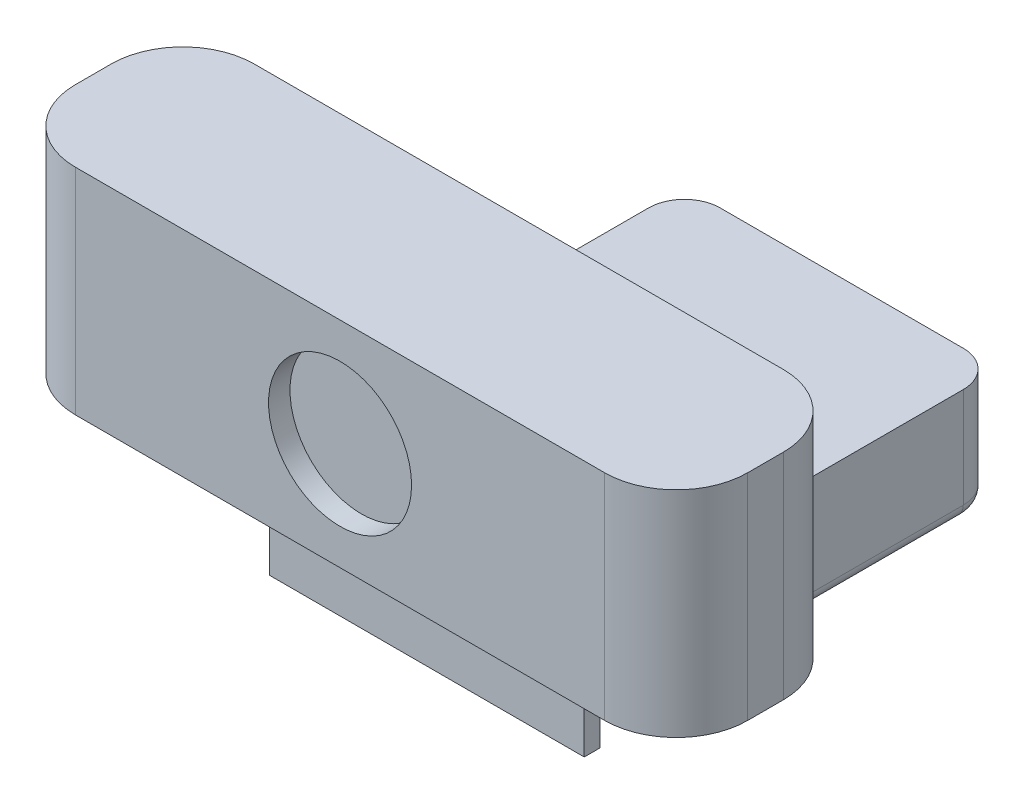
ISO-10303-21;
HEADER;
FILE_DESCRIPTION(('STEP AP214'),'2;1');
FILE_NAME('part.step','',(''),(''),'','','');
FILE_SCHEMA(('AUTOMOTIVE_DESIGN { 1 0 10303 214 1 1 1 1 }'));
ENDSEC;
DATA;
#1=APPLICATION_CONTEXT('core data for automotive mechanical design processes');
#2=APPLICATION_PROTOCOL_DEFINITION('international standard','automotive_design',2000,#1);
#3=PRODUCT_CONTEXT('',#1,'mechanical');
#4=PRODUCT('Part','Part','',(#3));
#5=PRODUCT_RELATED_PRODUCT_CATEGORY('part','',(#4));
#6=PRODUCT_DEFINITION_FORMATION('','',#4);
#7=PRODUCT_DEFINITION_CONTEXT('part definition',#1,'design');
#8=PRODUCT_DEFINITION('design','',#6,#7);
#9=PRODUCT_DEFINITION_SHAPE('','',#8);
#10=(LENGTH_UNIT() NAMED_UNIT(*) SI_UNIT(.MILLI.,.METRE.));
#11=(NAMED_UNIT(*) PLANE_ANGLE_UNIT() SI_UNIT($,.RADIAN.));
#12=(NAMED_UNIT(*) SI_UNIT($,.STERADIAN.) SOLID_ANGLE_UNIT());
#13=UNCERTAINTY_MEASURE_WITH_UNIT(LENGTH_MEASURE(1.E-05),#10,'distance_accuracy_value','');
#14=(GEOMETRIC_REPRESENTATION_CONTEXT(3) GLOBAL_UNCERTAINTY_ASSIGNED_CONTEXT((#13)) GLOBAL_UNIT_ASSIGNED_CONTEXT((#10,
#11,#12)) REPRESENTATION_CONTEXT('',''));
#15=CARTESIAN_POINT('',(0.,0.,0.));
#16=DIRECTION('',(0.,0.,1.));
#17=DIRECTION('',(1.,0.,0.));
#18=AXIS2_PLACEMENT_3D('',#15,#16,#17);
#19=CARTESIAN_POINT('',(22.,10.,-25.));
#20=DIRECTION('',(-1.,0.,0.));
#21=DIRECTION('',(0.,0.,1.));
#22=AXIS2_PLACEMENT_3D('',#19,#20,#21);
#23=PLANE('',#22);
#24=DIRECTION('',(0.,-1.,0.));
#25=VECTOR('',#24,1.);
#26=CARTESIAN_POINT('',(22.,10.,20.));
#27=LINE('',#26,#25);
#28=CARTESIAN_POINT('',(22.,9.99999999999999,20.));
#29=VERTEX_POINT('',#28);
#30=CARTESIAN_POINT('',(22.,2.,20.));
#31=VERTEX_POINT('',#30);
#32=EDGE_CURVE('E310',#29,#31,#27,.T.);
#33=ORIENTED_EDGE('',*,*,#32,.T.);
#34=DIRECTION('',(0.,0.,-1.));
#35=VECTOR('',#34,1.);
#36=CARTESIAN_POINT('',(22.,2.,-25.));
#37=LINE('',#36,#35);
#38=CARTESIAN_POINT('',(22.,2.,-20.));
#39=VERTEX_POINT('',#38);
#40=EDGE_CURVE('E372',#31,#39,#37,.T.);
#41=ORIENTED_EDGE('',*,*,#40,.T.);
#42=DIRECTION('',(0.,-1.,0.));
#43=VECTOR('',#42,1.);
#44=CARTESIAN_POINT('',(22.,10.,-20.));
#45=LINE('',#44,#43);
#46=CARTESIAN_POINT('',(22.,16.,-20.));
#47=VERTEX_POINT('',#46);
#48=EDGE_CURVE('E313',#39,#47,#45,.F.);
#49=ORIENTED_EDGE('',*,*,#48,.T.);
#50=DIRECTION('',(0.,0.,1.));
#51=VECTOR('',#50,1.);
#52=CARTESIAN_POINT('',(22.,16.,-25.));
#53=LINE('',#52,#51);
#54=CARTESIAN_POINT('',(22.,16.,20.1472553699283));
#55=VERTEX_POINT('',#54);
#56=EDGE_CURVE('E268',#47,#55,#53,.T.);
#57=ORIENTED_EDGE('',*,*,#56,.T.);
#58=CARTESIAN_POINT('',(22.,16.,33.));
#59=VERTEX_POINT('',#58);
#60=EDGE_CURVE('E271',#55,#59,#53,.T.);
#61=ORIENTED_EDGE('',*,*,#60,.T.);
#62=DIRECTION('',(0.,-1.,0.));
#63=VECTOR('',#62,1.);
#64=CARTESIAN_POINT('',(22.,10.,33.));
#65=LINE('',#64,#63);
#66=CARTESIAN_POINT('',(22.,-2.00000000000001,33.));
#67=VERTEX_POINT('',#66);
#68=EDGE_CURVE('E270',#59,#67,#65,.T.);
#69=ORIENTED_EDGE('',*,*,#68,.T.);
#70=DIRECTION('',(0.,0.,-1.));
#71=VECTOR('',#70,1.);
#72=CARTESIAN_POINT('',(22.,-2.00000000000001,33.));
#73=LINE('',#72,#71);
#74=CARTESIAN_POINT('',(22.,-2.00000000000001,30.8));
#75=VERTEX_POINT('',#74);
#76=EDGE_CURVE('E274',#67,#75,#73,.T.);
#77=ORIENTED_EDGE('',*,*,#76,.T.);
#78=DIRECTION('',(0.,1.,0.));
#79=VECTOR('',#78,1.);
#80=CARTESIAN_POINT('',(22.,9.99999999999999,30.8));
#81=LINE('',#80,#79);
#82=CARTESIAN_POINT('',(22.,9.99999999999999,30.8));
#83=VERTEX_POINT('',#82);
#84=EDGE_CURVE('E277',#75,#83,#81,.T.);
#85=ORIENTED_EDGE('',*,*,#84,.T.);
#86=DIRECTION('',(0.,0.,-1.));
#87=VECTOR('',#86,1.);
#88=CARTESIAN_POINT('',(22.,10.,-25.));
#89=LINE('',#88,#87);
#90=EDGE_CURVE('E280',#83,#29,#89,.T.);
#91=ORIENTED_EDGE('',*,*,#90,.T.);
#92=EDGE_LOOP('',(#33,#41,#49,#57,#61,#69,#77,#85,#91));
#93=FACE_BOUND('',#92,.T.);
#94=ADVANCED_FACE('F35',(#93),#23,.F.);
#95=CARTESIAN_POINT('',(-22.,10.,-25.));
#96=DIRECTION('',(0.,0.,1.));
#97=DIRECTION('',(1.,0.,0.));
#98=AXIS2_PLACEMENT_3D('',#95,#96,#97);
#99=PLANE('',#98);
#100=DIRECTION('',(0.,-1.,0.));
#101=VECTOR('',#100,1.);
#102=CARTESIAN_POINT('',(17.,10.,-25.));
#103=LINE('',#102,#101);
#104=CARTESIAN_POINT('',(17.,16.,-25.));
#105=VERTEX_POINT('',#104);
#106=CARTESIAN_POINT('',(17.,2.,-25.));
#107=VERTEX_POINT('',#106);
#108=EDGE_CURVE('E302',#105,#107,#103,.T.);
#109=ORIENTED_EDGE('',*,*,#108,.T.);
#110=DIRECTION('',(-1.,0.,0.));
#111=VECTOR('',#110,1.);
#112=CARTESIAN_POINT('',(-22.,2.,-25.));
#113=LINE('',#112,#111);
#114=CARTESIAN_POINT('',(-17.,2.,-25.));
#115=VERTEX_POINT('',#114);
#116=EDGE_CURVE('E376',#107,#115,#113,.T.);
#117=ORIENTED_EDGE('',*,*,#116,.T.);
#118=DIRECTION('',(0.,-1.,0.));
#119=VECTOR('',#118,1.);
#120=CARTESIAN_POINT('',(-17.,10.,-25.));
#121=LINE('',#120,#119);
#122=CARTESIAN_POINT('',(-17.,16.,-25.));
#123=VERTEX_POINT('',#122);
#124=EDGE_CURVE('E305',#115,#123,#121,.F.);
#125=ORIENTED_EDGE('',*,*,#124,.T.);
#126=DIRECTION('',(1.,0.,0.));
#127=VECTOR('',#126,1.);
#128=CARTESIAN_POINT('',(-82.7289058027559,16.,-25.));
#129=LINE('',#128,#127);
#130=EDGE_CURVE('E282',#123,#105,#129,.T.);
#131=ORIENTED_EDGE('',*,*,#130,.T.);
#132=EDGE_LOOP('',(#109,#117,#125,#131));
#133=FACE_BOUND('',#132,.T.);
#134=ADVANCED_FACE('F475',(#133),#99,.F.);
#135=CARTESIAN_POINT('',(-22.,10.,-25.));
#136=DIRECTION('',(1.,0.,0.));
#137=DIRECTION('',(0.,0.,-1.));
#138=AXIS2_PLACEMENT_3D('',#135,#136,#137);
#139=PLANE('',#138);
#140=DIRECTION('',(0.,-1.,0.));
#141=VECTOR('',#140,1.);
#142=CARTESIAN_POINT('',(-22.,10.,-20.));
#143=LINE('',#142,#141);
#144=CARTESIAN_POINT('',(-22.,16.,-20.));
#145=VERTEX_POINT('',#144);
#146=CARTESIAN_POINT('',(-22.,2.,-20.));
#147=VERTEX_POINT('',#146);
#148=EDGE_CURVE('E298',#145,#147,#143,.T.);
#149=ORIENTED_EDGE('',*,*,#148,.T.);
#150=DIRECTION('',(0.,0.,1.));
#151=VECTOR('',#150,1.);
#152=CARTESIAN_POINT('',(-22.,2.,-25.));
#153=LINE('',#152,#151);
#154=CARTESIAN_POINT('',(-22.,2.,20.));
#155=VERTEX_POINT('',#154);
#156=EDGE_CURVE('E60',#147,#155,#153,.T.);
#157=ORIENTED_EDGE('',*,*,#156,.T.);
#158=DIRECTION('',(0.,-1.,0.));
#159=VECTOR('',#158,1.);
#160=CARTESIAN_POINT('',(-22.,10.,20.));
#161=LINE('',#160,#159);
#162=CARTESIAN_POINT('',(-22.,9.99999999999999,20.));
#163=VERTEX_POINT('',#162);
#164=EDGE_CURVE('E300',#155,#163,#161,.F.);
#165=ORIENTED_EDGE('',*,*,#164,.T.);
#166=DIRECTION('',(0.,0.,1.));
#167=VECTOR('',#166,1.);
#168=CARTESIAN_POINT('',(-22.,10.,-25.));
#169=LINE('',#168,#167);
#170=CARTESIAN_POINT('',(-22.,9.99999999999999,30.8));
#171=VERTEX_POINT('',#170);
#172=EDGE_CURVE('E228',#163,#171,#169,.T.);
#173=ORIENTED_EDGE('',*,*,#172,.T.);
#174=DIRECTION('',(0.,-1.,0.));
#175=VECTOR('',#174,1.);
#176=CARTESIAN_POINT('',(-22.,9.99999999999999,30.8));
#177=LINE('',#176,#175);
#178=CARTESIAN_POINT('',(-22.,-2.00000000000001,30.8));
#179=VERTEX_POINT('',#178);
#180=EDGE_CURVE('E265',#171,#179,#177,.T.);
#181=ORIENTED_EDGE('',*,*,#180,.T.);
#182=DIRECTION('',(0.,0.,1.));
#183=VECTOR('',#182,1.);
#184=CARTESIAN_POINT('',(-22.,-2.00000000000001,33.));
#185=LINE('',#184,#183);
#186=CARTESIAN_POINT('',(-22.,-2.00000000000001,33.));
#187=VERTEX_POINT('',#186);
#188=EDGE_CURVE('E262',#179,#187,#185,.T.);
#189=ORIENTED_EDGE('',*,*,#188,.T.);
#190=DIRECTION('',(0.,1.,0.));
#191=VECTOR('',#190,1.);
#192=CARTESIAN_POINT('',(-22.,10.,33.));
#193=LINE('',#192,#191);
#194=CARTESIAN_POINT('',(-22.,16.,33.));
#195=VERTEX_POINT('',#194);
#196=EDGE_CURVE('E210',#187,#195,#193,.T.);
#197=ORIENTED_EDGE('',*,*,#196,.T.);
#198=DIRECTION('',(0.,0.,-1.));
#199=VECTOR('',#198,1.);
#200=CARTESIAN_POINT('',(-22.,16.,-25.));
#201=LINE('',#200,#199);
#202=CARTESIAN_POINT('',(-22.,16.,20.1472553699283));
#203=VERTEX_POINT('',#202);
#204=EDGE_CURVE('E204',#195,#203,#201,.T.);
#205=ORIENTED_EDGE('',*,*,#204,.T.);
#206=EDGE_CURVE('E207',#203,#145,#201,.T.);
#207=ORIENTED_EDGE('',*,*,#206,.T.);
#208=EDGE_LOOP('',(#149,#157,#165,#173,#181,#189,#197,#205,#207));
#209=FACE_BOUND('',#208,.T.);
#210=ADVANCED_FACE('F206',(#209),#139,.F.);
#211=CARTESIAN_POINT('',(-22.,10.,25.));
#212=DIRECTION('',(0.,0.,-1.));
#213=DIRECTION('',(-1.,0.,0.));
#214=AXIS2_PLACEMENT_3D('',#211,#212,#213);
#215=PLANE('',#214);
#216=DIRECTION('',(0.,-1.,0.));
#217=VECTOR('',#216,1.);
#218=CARTESIAN_POINT('',(-17.,10.,25.));
#219=LINE('',#218,#217);
#220=CARTESIAN_POINT('',(-17.,10.,25.));
#221=VERTEX_POINT('',#220);
#222=CARTESIAN_POINT('',(-17.,2.,25.));
#223=VERTEX_POINT('',#222);
#224=EDGE_CURVE('E296',#221,#223,#219,.T.);
#225=ORIENTED_EDGE('',*,*,#224,.T.);
#226=DIRECTION('',(1.,0.,0.));
#227=VECTOR('',#226,1.);
#228=CARTESIAN_POINT('',(-22.,2.,25.));
#229=LINE('',#228,#227);
#230=CARTESIAN_POINT('',(17.,2.,25.));
#231=VERTEX_POINT('',#230);
#232=EDGE_CURVE('E44',#223,#231,#229,.T.);
#233=ORIENTED_EDGE('',*,*,#232,.T.);
#234=DIRECTION('',(0.,-1.,0.));
#235=VECTOR('',#234,1.);
#236=CARTESIAN_POINT('',(17.,10.,25.));
#237=LINE('',#236,#235);
#238=CARTESIAN_POINT('',(17.,10.,25.));
#239=VERTEX_POINT('',#238);
#240=EDGE_CURVE('E294',#231,#239,#237,.F.);
#241=ORIENTED_EDGE('',*,*,#240,.T.);
#242=DIRECTION('',(1.,0.,0.));
#243=VECTOR('',#242,1.);
#244=CARTESIAN_POINT('',(-22.,10.,25.));
#245=LINE('',#244,#243);
#246=EDGE_CURVE('E215',#221,#239,#245,.T.);
#247=ORIENTED_EDGE('',*,*,#246,.F.);
#248=EDGE_LOOP('',(#225,#233,#241,#247));
#249=FACE_BOUND('',#248,.T.);
#250=ADVANCED_FACE('F600',(#249),#215,.F.);
#251=CARTESIAN_POINT('',(0.,0.,0.));
#252=DIRECTION('',(0.,1.,0.));
#253=DIRECTION('',(0.,0.,1.));
#254=AXIS2_PLACEMENT_3D('',#251,#252,#253);
#255=PLANE('',#254);
#256=DIRECTION('',(0.,0.,-1.));
#257=VECTOR('',#256,1.);
#258=CARTESIAN_POINT('',(20.,0.,0.));
#259=LINE('',#258,#257);
#260=CARTESIAN_POINT('',(20.,0.,-20.));
#261=VERTEX_POINT('',#260);
#262=CARTESIAN_POINT('',(20.,0.,20.));
#263=VERTEX_POINT('',#262);
#264=EDGE_CURVE('E364',#261,#263,#259,.F.);
#265=ORIENTED_EDGE('',*,*,#264,.T.);
#266=CARTESIAN_POINT('',(17.,0.,20.));
#267=DIRECTION('',(0.,1.,0.));
#268=DIRECTION('',(0.,0.,1.));
#269=AXIS2_PLACEMENT_3D('',#266,#267,#268);
#270=CIRCLE('',#269,3.);
#271=CARTESIAN_POINT('',(17.,0.,23.));
#272=VERTEX_POINT('',#271);
#273=EDGE_CURVE('E366',#263,#272,#270,.F.);
#274=ORIENTED_EDGE('',*,*,#273,.T.);
#275=DIRECTION('',(1.,0.,0.));
#276=VECTOR('',#275,1.);
#277=CARTESIAN_POINT('',(0.,0.,23.));
#278=LINE('',#277,#276);
#279=CARTESIAN_POINT('',(-17.,0.,23.));
#280=VERTEX_POINT('',#279);
#281=EDGE_CURVE('E352',#272,#280,#278,.F.);
#282=ORIENTED_EDGE('',*,*,#281,.T.);
#283=CARTESIAN_POINT('',(-17.,0.,20.));
#284=DIRECTION('',(0.,1.,0.));
#285=DIRECTION('',(0.,0.,1.));
#286=AXIS2_PLACEMENT_3D('',#283,#284,#285);
#287=CIRCLE('',#286,3.);
#288=CARTESIAN_POINT('',(-20.,0.,20.));
#289=VERTEX_POINT('',#288);
#290=EDGE_CURVE('E354',#280,#289,#287,.F.);
#291=ORIENTED_EDGE('',*,*,#290,.T.);
#292=DIRECTION('',(0.,0.,1.));
#293=VECTOR('',#292,1.);
#294=CARTESIAN_POINT('',(-20.,0.,0.));
#295=LINE('',#294,#293);
#296=CARTESIAN_POINT('',(-20.,0.,-20.));
#297=VERTEX_POINT('',#296);
#298=EDGE_CURVE('E356',#289,#297,#295,.F.);
#299=ORIENTED_EDGE('',*,*,#298,.T.);
#300=CARTESIAN_POINT('',(-17.,0.,-20.));
#301=DIRECTION('',(0.,1.,0.));
#302=DIRECTION('',(0.,0.,1.));
#303=AXIS2_PLACEMENT_3D('',#300,#301,#302);
#304=CIRCLE('',#303,3.);
#305=CARTESIAN_POINT('',(-17.,0.,-23.));
#306=VERTEX_POINT('',#305);
#307=EDGE_CURVE('E358',#297,#306,#304,.F.);
#308=ORIENTED_EDGE('',*,*,#307,.T.);
#309=DIRECTION('',(-1.,0.,0.));
#310=VECTOR('',#309,1.);
#311=CARTESIAN_POINT('',(0.,0.,-23.));
#312=LINE('',#311,#310);
#313=CARTESIAN_POINT('',(17.,0.,-23.));
#314=VERTEX_POINT('',#313);
#315=EDGE_CURVE('E360',#306,#314,#312,.F.);
#316=ORIENTED_EDGE('',*,*,#315,.T.);
#317=CARTESIAN_POINT('',(17.,0.,-20.));
#318=DIRECTION('',(0.,1.,0.));
#319=DIRECTION('',(0.,0.,1.));
#320=AXIS2_PLACEMENT_3D('',#317,#318,#319);
#321=CIRCLE('',#320,3.);
#322=EDGE_CURVE('E362',#314,#261,#321,.F.);
#323=ORIENTED_EDGE('',*,*,#322,.T.);
#324=EDGE_LOOP('',(#265,#274,#282,#291,#299,#308,#316,#323));
#325=FACE_BOUND('',#324,.T.);
#326=CARTESIAN_POINT('',(0.,0.,4.99999999999999));
#327=DIRECTION('',(0.,1.,0.));
#328=DIRECTION('',(0.,0.,1.));
#329=AXIS2_PLACEMENT_3D('',#326,#327,#328);
#330=CIRCLE('',#329,4.32842712474618);
#331=CARTESIAN_POINT('',(0.,0.,9.32842712474618));
#332=VERTEX_POINT('',#331);
#333=EDGE_CURVE('E349',#332,#332,#330,.T.);
#334=ORIENTED_EDGE('',*,*,#333,.T.);
#335=EDGE_LOOP('',(#334));
#336=FACE_BOUND('',#335,.T.);
#337=ADVANCED_FACE('F583',(#325,#336),#255,.F.);
#338=CARTESIAN_POINT('',(-82.7289058027559,10.,-25.));
#339=DIRECTION('',(0.,-1.,0.));
#340=DIRECTION('',(0.,0.,-1.));
#341=AXIS2_PLACEMENT_3D('',#338,#339,#340);
#342=PLANE('',#341);
#343=ORIENTED_EDGE('',*,*,#172,.F.);
#344=CARTESIAN_POINT('',(-17.,9.99999999999999,20.));
#345=DIRECTION('',(0.,-1.,0.));
#346=DIRECTION('',(0.,0.,-1.));
#347=AXIS2_PLACEMENT_3D('',#344,#345,#346);
#348=CIRCLE('',#347,5.);
#349=EDGE_CURVE('E247',#163,#221,#348,.F.);
#350=ORIENTED_EDGE('',*,*,#349,.T.);
#351=ORIENTED_EDGE('',*,*,#246,.T.);
#352=CARTESIAN_POINT('',(17.,9.99999999999999,20.));
#353=DIRECTION('',(0.,-1.,0.));
#354=DIRECTION('',(0.,0.,-1.));
#355=AXIS2_PLACEMENT_3D('',#352,#353,#354);
#356=CIRCLE('',#355,5.);
#357=EDGE_CURVE('E243',#239,#29,#356,.F.);
#358=ORIENTED_EDGE('',*,*,#357,.T.);
#359=ORIENTED_EDGE('',*,*,#90,.F.);
#360=DIRECTION('',(1.,0.,0.));
#361=VECTOR('',#360,1.);
#362=CARTESIAN_POINT('',(-82.7289058027559,9.99999999999999,30.8));
#363=LINE('',#362,#361);
#364=EDGE_CURVE('E263',#171,#83,#363,.T.);
#365=ORIENTED_EDGE('',*,*,#364,.F.);
#366=EDGE_LOOP('',(#343,#350,#351,#358,#359,#365));
#367=FACE_BOUND('',#366,.T.);
#368=ADVANCED_FACE('F579',(#367),#342,.T.);
#369=CARTESIAN_POINT('',(-82.7289058027559,9.99999999999999,30.8));
#370=DIRECTION('',(0.,0.,-1.));
#371=DIRECTION('',(-1.,0.,0.));
#372=AXIS2_PLACEMENT_3D('',#369,#370,#371);
#373=PLANE('',#372);
#374=ORIENTED_EDGE('',*,*,#180,.F.);
#375=ORIENTED_EDGE('',*,*,#364,.T.);
#376=ORIENTED_EDGE('',*,*,#84,.F.);
#377=DIRECTION('',(1.,0.,0.));
#378=VECTOR('',#377,1.);
#379=CARTESIAN_POINT('',(-82.7289058027559,-2.00000000000001,30.8));
#380=LINE('',#379,#378);
#381=EDGE_CURVE('E284',#179,#75,#380,.T.);
#382=ORIENTED_EDGE('',*,*,#381,.F.);
#383=EDGE_LOOP('',(#374,#375,#376,#382));
#384=FACE_BOUND('',#383,.T.);
#385=ADVANCED_FACE('F582',(#384),#373,.T.);
#386=CARTESIAN_POINT('',(-82.7289058027559,-2.00000000000001,33.));
#387=DIRECTION('',(0.,-1.,0.));
#388=DIRECTION('',(0.,0.,-1.));
#389=AXIS2_PLACEMENT_3D('',#386,#387,#388);
#390=PLANE('',#389);
#391=ORIENTED_EDGE('',*,*,#188,.F.);
#392=ORIENTED_EDGE('',*,*,#381,.T.);
#393=ORIENTED_EDGE('',*,*,#76,.F.);
#394=DIRECTION('',(1.,0.,0.));
#395=VECTOR('',#394,1.);
#396=CARTESIAN_POINT('',(-82.7289058027559,-2.00000000000001,33.));
#397=LINE('',#396,#395);
#398=EDGE_CURVE('E286',#187,#67,#397,.T.);
#399=ORIENTED_EDGE('',*,*,#398,.F.);
#400=EDGE_LOOP('',(#391,#392,#393,#399));
#401=FACE_BOUND('',#400,.T.);
#402=ADVANCED_FACE('F587',(#401),#390,.T.);
#403=CARTESIAN_POINT('',(-82.7289058027559,10.,33.));
#404=DIRECTION('',(0.,0.,1.));
#405=DIRECTION('',(1.,0.,0.));
#406=AXIS2_PLACEMENT_3D('',#403,#404,#405);
#407=PLANE('',#406);
#408=ORIENTED_EDGE('',*,*,#196,.F.);
#409=ORIENTED_EDGE('',*,*,#398,.T.);
#410=ORIENTED_EDGE('',*,*,#68,.F.);
#411=DIRECTION('',(1.,0.,0.));
#412=VECTOR('',#411,1.);
#413=CARTESIAN_POINT('',(-82.7289058027559,16.,33.));
#414=LINE('',#413,#412);
#415=EDGE_CURVE('E288',#195,#59,#414,.T.);
#416=ORIENTED_EDGE('',*,*,#415,.F.);
#417=EDGE_LOOP('',(#408,#409,#410,#416));
#418=FACE_BOUND('',#417,.T.);
#419=ADVANCED_FACE('F591',(#418),#407,.T.);
#420=CARTESIAN_POINT('',(-82.7289058027559,16.,-25.));
#421=DIRECTION('',(0.,1.,0.));
#422=DIRECTION('',(0.,0.,1.));
#423=AXIS2_PLACEMENT_3D('',#420,#421,#422);
#424=PLANE('',#423);
#425=DIRECTION('',(-1.,0.,0.));
#426=VECTOR('',#425,1.);
#427=CARTESIAN_POINT('',(-47.,16.,20.1472553699283));
#428=LINE('',#427,#426);
#429=EDGE_CURVE('E222',#55,#203,#428,.T.);
#430=ORIENTED_EDGE('',*,*,#429,.F.);
#431=ORIENTED_EDGE('',*,*,#56,.F.);
#432=CARTESIAN_POINT('',(17.,16.,-20.));
#433=DIRECTION('',(0.,1.,0.));
#434=DIRECTION('',(0.,0.,1.));
#435=AXIS2_PLACEMENT_3D('',#432,#433,#434);
#436=CIRCLE('',#435,5.);
#437=EDGE_CURVE('E307',#47,#105,#436,.T.);
#438=ORIENTED_EDGE('',*,*,#437,.T.);
#439=ORIENTED_EDGE('',*,*,#130,.F.);
#440=CARTESIAN_POINT('',(-17.,16.,-20.));
#441=DIRECTION('',(0.,1.,0.));
#442=DIRECTION('',(0.,0.,1.));
#443=AXIS2_PLACEMENT_3D('',#440,#441,#442);
#444=CIRCLE('',#443,5.);
#445=EDGE_CURVE('E226',#123,#145,#444,.T.);
#446=ORIENTED_EDGE('',*,*,#445,.T.);
#447=ORIENTED_EDGE('',*,*,#206,.F.);
#448=EDGE_LOOP('',(#430,#431,#438,#439,#446,#447));
#449=FACE_BOUND('',#448,.T.);
#450=ADVANCED_FACE('F219',(#449),#424,.T.);
#451=CARTESIAN_POINT('',(-17.,10.,20.));
#452=DIRECTION('',(0.,-1.,0.));
#453=DIRECTION('',(0.,0.,-1.));
#454=AXIS2_PLACEMENT_3D('',#451,#452,#453);
#455=CYLINDRICAL_SURFACE('',#454,5.);
#456=ORIENTED_EDGE('',*,*,#164,.F.);
#457=CARTESIAN_POINT('',(-17.,2.,20.));
#458=DIRECTION('',(0.,1.,0.));
#459=DIRECTION('',(0.,0.,1.));
#460=AXIS2_PLACEMENT_3D('',#457,#458,#459);
#461=CIRCLE('',#460,5.);
#462=EDGE_CURVE('E52',#155,#223,#461,.T.);
#463=ORIENTED_EDGE('',*,*,#462,.T.);
#464=ORIENTED_EDGE('',*,*,#224,.F.);
#465=ORIENTED_EDGE('',*,*,#349,.F.);
#466=EDGE_LOOP('',(#456,#463,#464,#465));
#467=FACE_BOUND('',#466,.T.);
#468=ADVANCED_FACE('F486',(#467),#455,.T.);
#469=CARTESIAN_POINT('',(-17.,10.,-20.));
#470=DIRECTION('',(0.,-1.,0.));
#471=DIRECTION('',(0.,0.,-1.));
#472=AXIS2_PLACEMENT_3D('',#469,#470,#471);
#473=CYLINDRICAL_SURFACE('',#472,5.);
#474=ORIENTED_EDGE('',*,*,#124,.F.);
#475=CARTESIAN_POINT('',(-17.,2.,-20.));
#476=DIRECTION('',(0.,1.,0.));
#477=DIRECTION('',(0.,0.,1.));
#478=AXIS2_PLACEMENT_3D('',#475,#476,#477);
#479=CIRCLE('',#478,5.);
#480=EDGE_CURVE('E378',#115,#147,#479,.T.);
#481=ORIENTED_EDGE('',*,*,#480,.T.);
#482=ORIENTED_EDGE('',*,*,#148,.F.);
#483=ORIENTED_EDGE('',*,*,#445,.F.);
#484=EDGE_LOOP('',(#474,#481,#482,#483));
#485=FACE_BOUND('',#484,.T.);
#486=ADVANCED_FACE('F489',(#485),#473,.T.);
#487=CARTESIAN_POINT('',(17.,10.,-20.));
#488=DIRECTION('',(0.,-1.,0.));
#489=DIRECTION('',(0.,0.,-1.));
#490=AXIS2_PLACEMENT_3D('',#487,#488,#489);
#491=CYLINDRICAL_SURFACE('',#490,5.);
#492=ORIENTED_EDGE('',*,*,#48,.F.);
#493=CARTESIAN_POINT('',(17.,2.,-20.));
#494=DIRECTION('',(0.,1.,0.));
#495=DIRECTION('',(0.,0.,1.));
#496=AXIS2_PLACEMENT_3D('',#493,#494,#495);
#497=CIRCLE('',#496,5.);
#498=EDGE_CURVE('E374',#39,#107,#497,.T.);
#499=ORIENTED_EDGE('',*,*,#498,.T.);
#500=ORIENTED_EDGE('',*,*,#108,.F.);
#501=ORIENTED_EDGE('',*,*,#437,.F.);
#502=EDGE_LOOP('',(#492,#499,#500,#501));
#503=FACE_BOUND('',#502,.T.);
#504=ADVANCED_FACE('F492',(#503),#491,.T.);
#505=CARTESIAN_POINT('',(17.,10.,20.));
#506=DIRECTION('',(0.,-1.,0.));
#507=DIRECTION('',(0.,0.,-1.));
#508=AXIS2_PLACEMENT_3D('',#505,#506,#507);
#509=CYLINDRICAL_SURFACE('',#508,5.);
#510=ORIENTED_EDGE('',*,*,#240,.F.);
#511=CARTESIAN_POINT('',(17.,2.,20.));
#512=DIRECTION('',(0.,1.,0.));
#513=DIRECTION('',(0.,0.,1.));
#514=AXIS2_PLACEMENT_3D('',#511,#512,#513);
#515=CIRCLE('',#514,5.);
#516=EDGE_CURVE('E369',#231,#31,#515,.T.);
#517=ORIENTED_EDGE('',*,*,#516,.T.);
#518=ORIENTED_EDGE('',*,*,#32,.F.);
#519=ORIENTED_EDGE('',*,*,#357,.F.);
#520=EDGE_LOOP('',(#510,#517,#518,#519));
#521=FACE_BOUND('',#520,.T.);
#522=ADVANCED_FACE('F496',(#521),#509,.T.);
#523=CARTESIAN_POINT('',(47.,46.,20.1472553699283));
#524=DIRECTION('',(-1.,0.,0.));
#525=DIRECTION('',(0.,0.,1.));
#526=AXIS2_PLACEMENT_3D('',#523,#524,#525);
#527=PLANE('',#526);
#528=DIRECTION('',(0.,0.,-1.));
#529=VECTOR('',#528,1.);
#530=CARTESIAN_POINT('',(47.,16.,20.1472553699283));
#531=LINE('',#530,#529);
#532=CARTESIAN_POINT('',(47.,16.,35.1472553699283));
#533=VERTEX_POINT('',#532);
#534=CARTESIAN_POINT('',(47.,16.,30.1472553699283));
#535=VERTEX_POINT('',#534);
#536=EDGE_CURVE('E237',#533,#535,#531,.T.);
#537=ORIENTED_EDGE('',*,*,#536,.T.);
#538=DIRECTION('',(0.,-1.,0.));
#539=VECTOR('',#538,1.);
#540=CARTESIAN_POINT('',(47.,46.,30.1472553699283));
#541=LINE('',#540,#539);
#542=CARTESIAN_POINT('',(47.,46.,30.1472553699283));
#543=VERTEX_POINT('',#542);
#544=EDGE_CURVE('E344',#535,#543,#541,.F.);
#545=ORIENTED_EDGE('',*,*,#544,.T.);
#546=DIRECTION('',(0.,0.,-1.));
#547=VECTOR('',#546,1.);
#548=CARTESIAN_POINT('',(47.,46.,20.1472553699283));
#549=LINE('',#548,#547);
#550=CARTESIAN_POINT('',(47.,46.,35.1472553699283));
#551=VERTEX_POINT('',#550);
#552=EDGE_CURVE('E258',#551,#543,#549,.T.);
#553=ORIENTED_EDGE('',*,*,#552,.F.);
#554=DIRECTION('',(0.,-1.,0.));
#555=VECTOR('',#554,1.);
#556=CARTESIAN_POINT('',(47.,46.,35.1472553699283));
#557=LINE('',#556,#555);
#558=EDGE_CURVE('E341',#551,#533,#557,.T.);
#559=ORIENTED_EDGE('',*,*,#558,.T.);
#560=EDGE_LOOP('',(#537,#545,#553,#559));
#561=FACE_BOUND('',#560,.T.);
#562=ADVANCED_FACE('F434',(#561),#527,.F.);
#563=CARTESIAN_POINT('',(-47.,46.,20.1472553699283));
#564=DIRECTION('',(0.,0.,1.));
#565=DIRECTION('',(0.,-1.,0.));
#566=AXIS2_PLACEMENT_3D('',#563,#564,#565);
#567=PLANE('',#566);
#568=CARTESIAN_POINT('',(-37.,16.,20.1472553699283));
#569=VERTEX_POINT('',#568);
#570=EDGE_CURVE('E230',#203,#569,#428,.T.);
#571=ORIENTED_EDGE('',*,*,#570,.T.);
#572=DIRECTION('',(0.,-1.,0.));
#573=VECTOR('',#572,1.);
#574=CARTESIAN_POINT('',(-37.,46.,20.1472553699283));
#575=LINE('',#574,#573);
#576=CARTESIAN_POINT('',(-37.,46.,20.1472553699283));
#577=VERTEX_POINT('',#576);
#578=EDGE_CURVE('E326',#569,#577,#575,.F.);
#579=ORIENTED_EDGE('',*,*,#578,.T.);
#580=DIRECTION('',(-1.,0.,0.));
#581=VECTOR('',#580,1.);
#582=CARTESIAN_POINT('',(-47.,46.,20.1472553699283));
#583=LINE('',#582,#581);
#584=CARTESIAN_POINT('',(37.,46.,20.1472553699283));
#585=VERTEX_POINT('',#584);
#586=EDGE_CURVE('E422',#585,#577,#583,.T.);
#587=ORIENTED_EDGE('',*,*,#586,.F.);
#588=DIRECTION('',(0.,-1.,0.));
#589=VECTOR('',#588,1.);
#590=CARTESIAN_POINT('',(37.,46.,20.1472553699283));
#591=LINE('',#590,#589);
#592=CARTESIAN_POINT('',(37.,16.,20.1472553699283));
#593=VERTEX_POINT('',#592);
#594=EDGE_CURVE('E324',#585,#593,#591,.T.);
#595=ORIENTED_EDGE('',*,*,#594,.T.);
#596=EDGE_CURVE('E236',#593,#55,#428,.T.);
#597=ORIENTED_EDGE('',*,*,#596,.T.);
#598=ORIENTED_EDGE('',*,*,#429,.T.);
#599=EDGE_LOOP('',(#571,#579,#587,#595,#597,#598));
#600=FACE_BOUND('',#599,.T.);
#601=ADVANCED_FACE('F239',(#600),#567,.F.);
#602=CARTESIAN_POINT('',(-47.,46.,20.1472553699283));
#603=DIRECTION('',(1.,0.,0.));
#604=DIRECTION('',(0.,0.,-1.));
#605=AXIS2_PLACEMENT_3D('',#602,#603,#604);
#606=PLANE('',#605);
#607=DIRECTION('',(0.,0.,1.));
#608=VECTOR('',#607,1.);
#609=CARTESIAN_POINT('',(-47.,46.,20.1472553699283));
#610=LINE('',#609,#608);
#611=CARTESIAN_POINT('',(-47.,46.,30.1472553699283));
#612=VERTEX_POINT('',#611);
#613=CARTESIAN_POINT('',(-47.,46.,35.1472553699283));
#614=VERTEX_POINT('',#613);
#615=EDGE_CURVE('E425',#612,#614,#610,.T.);
#616=ORIENTED_EDGE('',*,*,#615,.F.);
#617=DIRECTION('',(0.,-1.,0.));
#618=VECTOR('',#617,1.);
#619=CARTESIAN_POINT('',(-47.,46.,30.1472553699283));
#620=LINE('',#619,#618);
#621=CARTESIAN_POINT('',(-47.,16.,30.1472553699283));
#622=VERTEX_POINT('',#621);
#623=EDGE_CURVE('E244',#612,#622,#620,.T.);
#624=ORIENTED_EDGE('',*,*,#623,.T.);
#625=DIRECTION('',(0.,0.,1.));
#626=VECTOR('',#625,1.);
#627=CARTESIAN_POINT('',(-47.,16.,20.1472553699283));
#628=LINE('',#627,#626);
#629=CARTESIAN_POINT('',(-47.,16.,35.1472553699283));
#630=VERTEX_POINT('',#629);
#631=EDGE_CURVE('E251',#622,#630,#628,.T.);
#632=ORIENTED_EDGE('',*,*,#631,.T.);
#633=DIRECTION('',(0.,-1.,0.));
#634=VECTOR('',#633,1.);
#635=CARTESIAN_POINT('',(-47.,46.,35.1472553699283));
#636=LINE('',#635,#634);
#637=EDGE_CURVE('E242',#630,#614,#636,.F.);
#638=ORIENTED_EDGE('',*,*,#637,.T.);
#639=EDGE_LOOP('',(#616,#624,#632,#638));
#640=FACE_BOUND('',#639,.T.);
#641=ADVANCED_FACE('F450',(#640),#606,.F.);
#642=CARTESIAN_POINT('',(-47.,46.,45.1472553699283));
#643=DIRECTION('',(0.,0.,-1.));
#644=DIRECTION('',(0.,1.,0.));
#645=AXIS2_PLACEMENT_3D('',#642,#643,#644);
#646=PLANE('',#645);
#647=CARTESIAN_POINT('',(0.,31.,45.1472553699283));
#648=DIRECTION('',(0.,0.,1.));
#649=DIRECTION('',(1.,0.,0.));
#650=AXIS2_PLACEMENT_3D('',#647,#648,#649);
#651=CIRCLE('',#650,10.);
#652=CARTESIAN_POINT('',(10.,31.,45.1472553699283));
#653=VERTEX_POINT('',#652);
#654=EDGE_CURVE('E410',#653,#653,#651,.T.);
#655=ORIENTED_EDGE('',*,*,#654,.F.);
#656=EDGE_LOOP('',(#655));
#657=FACE_BOUND('',#656,.T.);
#658=DIRECTION('',(1.,0.,0.));
#659=VECTOR('',#658,1.);
#660=CARTESIAN_POINT('',(-47.,46.,45.1472553699283));
#661=LINE('',#660,#659);
#662=CARTESIAN_POINT('',(-37.,46.,45.1472553699283));
#663=VERTEX_POINT('',#662);
#664=CARTESIAN_POINT('',(37.,46.,45.1472553699283));
#665=VERTEX_POINT('',#664);
#666=EDGE_CURVE('E428',#663,#665,#661,.T.);
#667=ORIENTED_EDGE('',*,*,#666,.F.);
#668=DIRECTION('',(0.,-1.,0.));
#669=VECTOR('',#668,1.);
#670=CARTESIAN_POINT('',(-37.,46.,45.1472553699283));
#671=LINE('',#670,#669);
#672=CARTESIAN_POINT('',(-37.,16.,45.1472553699283));
#673=VERTEX_POINT('',#672);
#674=EDGE_CURVE('E338',#663,#673,#671,.T.);
#675=ORIENTED_EDGE('',*,*,#674,.T.);
#676=DIRECTION('',(1.,0.,0.));
#677=VECTOR('',#676,1.);
#678=CARTESIAN_POINT('',(-47.,16.,45.1472553699283));
#679=LINE('',#678,#677);
#680=CARTESIAN_POINT('',(37.,16.,45.1472553699283));
#681=VERTEX_POINT('',#680);
#682=EDGE_CURVE('E253',#673,#681,#679,.T.);
#683=ORIENTED_EDGE('',*,*,#682,.T.);
#684=DIRECTION('',(0.,-1.,0.));
#685=VECTOR('',#684,1.);
#686=CARTESIAN_POINT('',(37.,46.,45.1472553699283));
#687=LINE('',#686,#685);
#688=EDGE_CURVE('E336',#681,#665,#687,.F.);
#689=ORIENTED_EDGE('',*,*,#688,.T.);
#690=EDGE_LOOP('',(#667,#675,#683,#689));
#691=FACE_BOUND('',#690,.T.);
#692=ADVANCED_FACE('F457',(#657,#691),#646,.F.);
#693=CARTESIAN_POINT('',(0.,46.,0.));
#694=DIRECTION('',(0.,1.,0.));
#695=DIRECTION('',(0.,0.,1.));
#696=AXIS2_PLACEMENT_3D('',#693,#694,#695);
#697=PLANE('',#696);
#698=ORIENTED_EDGE('',*,*,#586,.T.);
#699=CARTESIAN_POINT('',(-37.,46.,30.1472553699283));
#700=DIRECTION('',(0.,1.,0.));
#701=DIRECTION('',(0.,0.,1.));
#702=AXIS2_PLACEMENT_3D('',#699,#700,#701);
#703=CIRCLE('',#702,10.);
#704=EDGE_CURVE('E334',#577,#612,#703,.T.);
#705=ORIENTED_EDGE('',*,*,#704,.T.);
#706=ORIENTED_EDGE('',*,*,#615,.T.);
#707=CARTESIAN_POINT('',(-37.,46.,35.1472553699283));
#708=DIRECTION('',(0.,1.,0.));
#709=DIRECTION('',(0.,0.,1.));
#710=AXIS2_PLACEMENT_3D('',#707,#708,#709);
#711=CIRCLE('',#710,10.);
#712=EDGE_CURVE('E332',#614,#663,#711,.T.);
#713=ORIENTED_EDGE('',*,*,#712,.T.);
#714=ORIENTED_EDGE('',*,*,#666,.T.);
#715=CARTESIAN_POINT('',(37.,46.,35.1472553699283));
#716=DIRECTION('',(0.,1.,0.));
#717=DIRECTION('',(0.,0.,1.));
#718=AXIS2_PLACEMENT_3D('',#715,#716,#717);
#719=CIRCLE('',#718,10.);
#720=EDGE_CURVE('E328',#665,#551,#719,.T.);
#721=ORIENTED_EDGE('',*,*,#720,.T.);
#722=ORIENTED_EDGE('',*,*,#552,.T.);
#723=CARTESIAN_POINT('',(37.,46.,30.1472553699283));
#724=DIRECTION('',(0.,1.,0.));
#725=DIRECTION('',(0.,0.,1.));
#726=AXIS2_PLACEMENT_3D('',#723,#724,#725);
#727=CIRCLE('',#726,10.);
#728=EDGE_CURVE('E330',#543,#585,#727,.T.);
#729=ORIENTED_EDGE('',*,*,#728,.T.);
#730=EDGE_LOOP('',(#698,#705,#706,#713,#714,#721,#722,#729));
#731=FACE_BOUND('',#730,.T.);
#732=ADVANCED_FACE('F443',(#731),#697,.T.);
#733=CARTESIAN_POINT('',(0.,16.,0.));
#734=DIRECTION('',(0.,1.,0.));
#735=DIRECTION('',(0.,0.,1.));
#736=AXIS2_PLACEMENT_3D('',#733,#734,#735);
#737=PLANE('',#736);
#738=ORIENTED_EDGE('',*,*,#631,.F.);
#739=CARTESIAN_POINT('',(-37.,16.,30.1472553699283));
#740=DIRECTION('',(0.,1.,0.));
#741=DIRECTION('',(0.,0.,1.));
#742=AXIS2_PLACEMENT_3D('',#739,#740,#741);
#743=CIRCLE('',#742,10.);
#744=EDGE_CURVE('E233',#622,#569,#743,.F.);
#745=ORIENTED_EDGE('',*,*,#744,.T.);
#746=ORIENTED_EDGE('',*,*,#570,.F.);
#747=ORIENTED_EDGE('',*,*,#204,.F.);
#748=ORIENTED_EDGE('',*,*,#415,.T.);
#749=ORIENTED_EDGE('',*,*,#60,.F.);
#750=ORIENTED_EDGE('',*,*,#596,.F.);
#751=CARTESIAN_POINT('',(37.,16.,30.1472553699283));
#752=DIRECTION('',(0.,1.,0.));
#753=DIRECTION('',(0.,0.,1.));
#754=AXIS2_PLACEMENT_3D('',#751,#752,#753);
#755=CIRCLE('',#754,10.);
#756=EDGE_CURVE('E319',#593,#535,#755,.F.);
#757=ORIENTED_EDGE('',*,*,#756,.T.);
#758=ORIENTED_EDGE('',*,*,#536,.F.);
#759=CARTESIAN_POINT('',(37.,16.,35.1472553699283));
#760=DIRECTION('',(0.,1.,0.));
#761=DIRECTION('',(0.,0.,1.));
#762=AXIS2_PLACEMENT_3D('',#759,#760,#761);
#763=CIRCLE('',#762,10.);
#764=EDGE_CURVE('E317',#533,#681,#763,.F.);
#765=ORIENTED_EDGE('',*,*,#764,.T.);
#766=ORIENTED_EDGE('',*,*,#682,.F.);
#767=CARTESIAN_POINT('',(-37.,16.,35.1472553699283));
#768=DIRECTION('',(0.,1.,0.));
#769=DIRECTION('',(0.,0.,1.));
#770=AXIS2_PLACEMENT_3D('',#767,#768,#769);
#771=CIRCLE('',#770,10.);
#772=EDGE_CURVE('E321',#673,#630,#771,.F.);
#773=ORIENTED_EDGE('',*,*,#772,.T.);
#774=EDGE_LOOP('',(#738,#745,#746,#747,#748,#749,#750,#757,#758,#765,#766,#773));
#775=FACE_BOUND('',#774,.T.);
#776=ADVANCED_FACE('F232',(#775),#737,.F.);
#777=CARTESIAN_POINT('',(-37.,46.,30.1472553699283));
#778=DIRECTION('',(0.,-1.,0.));
#779=DIRECTION('',(0.,0.,-1.));
#780=AXIS2_PLACEMENT_3D('',#777,#778,#779);
#781=CYLINDRICAL_SURFACE('',#780,10.);
#782=ORIENTED_EDGE('',*,*,#704,.F.);
#783=ORIENTED_EDGE('',*,*,#578,.F.);
#784=ORIENTED_EDGE('',*,*,#744,.F.);
#785=ORIENTED_EDGE('',*,*,#623,.F.);
#786=EDGE_LOOP('',(#782,#783,#784,#785));
#787=FACE_BOUND('',#786,.T.);
#788=ADVANCED_FACE('F446',(#787),#781,.T.);
#789=CARTESIAN_POINT('',(-37.,46.,35.1472553699283));
#790=DIRECTION('',(0.,-1.,0.));
#791=DIRECTION('',(0.,0.,-1.));
#792=AXIS2_PLACEMENT_3D('',#789,#790,#791);
#793=CYLINDRICAL_SURFACE('',#792,10.);
#794=ORIENTED_EDGE('',*,*,#712,.F.);
#795=ORIENTED_EDGE('',*,*,#637,.F.);
#796=ORIENTED_EDGE('',*,*,#772,.F.);
#797=ORIENTED_EDGE('',*,*,#674,.F.);
#798=EDGE_LOOP('',(#794,#795,#796,#797));
#799=FACE_BOUND('',#798,.T.);
#800=ADVANCED_FACE('F452',(#799),#793,.T.);
#801=CARTESIAN_POINT('',(37.,46.,30.1472553699283));
#802=DIRECTION('',(0.,-1.,0.));
#803=DIRECTION('',(0.,0.,-1.));
#804=AXIS2_PLACEMENT_3D('',#801,#802,#803);
#805=CYLINDRICAL_SURFACE('',#804,10.);
#806=ORIENTED_EDGE('',*,*,#728,.F.);
#807=ORIENTED_EDGE('',*,*,#544,.F.);
#808=ORIENTED_EDGE('',*,*,#756,.F.);
#809=ORIENTED_EDGE('',*,*,#594,.F.);
#810=EDGE_LOOP('',(#806,#807,#808,#809));
#811=FACE_BOUND('',#810,.T.);
#812=ADVANCED_FACE('F439',(#811),#805,.T.);
#813=CARTESIAN_POINT('',(37.,46.,35.1472553699283));
#814=DIRECTION('',(0.,-1.,0.));
#815=DIRECTION('',(0.,0.,-1.));
#816=AXIS2_PLACEMENT_3D('',#813,#814,#815);
#817=CYLINDRICAL_SURFACE('',#816,10.);
#818=ORIENTED_EDGE('',*,*,#720,.F.);
#819=ORIENTED_EDGE('',*,*,#688,.F.);
#820=ORIENTED_EDGE('',*,*,#764,.F.);
#821=ORIENTED_EDGE('',*,*,#558,.F.);
#822=EDGE_LOOP('',(#818,#819,#820,#821));
#823=FACE_BOUND('',#822,.T.);
#824=ADVANCED_FACE('F461',(#823),#817,.T.);
#825=CARTESIAN_POINT('',(0.,31.,42.1472553699283));
#826=DIRECTION('',(0.,0.,1.));
#827=DIRECTION('',(1.,0.,0.));
#828=AXIS2_PLACEMENT_3D('',#825,#826,#827);
#829=CYLINDRICAL_SURFACE('',#828,10.);
#830=CARTESIAN_POINT('',(0.,31.,42.1472553699283));
#831=DIRECTION('',(0.,0.,1.));
#832=DIRECTION('',(1.,0.,0.));
#833=AXIS2_PLACEMENT_3D('',#830,#831,#832);
#834=CIRCLE('',#833,10.);
#835=CARTESIAN_POINT('',(10.,31.,42.1472553699283));
#836=VERTEX_POINT('',#835);
#837=EDGE_CURVE('E415',#836,#836,#834,.T.);
#838=ORIENTED_EDGE('',*,*,#837,.F.);
#839=EDGE_LOOP('',(#838));
#840=FACE_BOUND('',#839,.T.);
#841=ORIENTED_EDGE('',*,*,#654,.T.);
#842=EDGE_LOOP('',(#841));
#843=FACE_BOUND('',#842,.T.);
#844=ADVANCED_FACE('F463',(#840,#843),#829,.F.);
#845=CARTESIAN_POINT('',(0.,31.,42.1472553699283));
#846=DIRECTION('',(0.,0.,1.));
#847=DIRECTION('',(1.,0.,0.));
#848=AXIS2_PLACEMENT_3D('',#845,#846,#847);
#849=PLANE('',#848);
#850=ORIENTED_EDGE('',*,*,#837,.T.);
#851=EDGE_LOOP('',(#850));
#852=FACE_BOUND('',#851,.T.);
#853=ADVANCED_FACE('F469',(#852),#849,.T.);
#854=CARTESIAN_POINT('',(0.,10.,4.99999999999999));
#855=DIRECTION('',(0.,-1.,0.));
#856=DIRECTION('',(0.,0.,-1.));
#857=AXIS2_PLACEMENT_3D('',#854,#855,#856);
#858=CYLINDRICAL_SURFACE('',#857,2.5);
#859=CARTESIAN_POINT('',(0.,0.999999999999984,4.99999999999999));
#860=DIRECTION('',(0.,1.,0.));
#861=DIRECTION('',(0.,0.,1.));
#862=AXIS2_PLACEMENT_3D('',#859,#860,#861);
#863=CIRCLE('',#862,2.5);
#864=CARTESIAN_POINT('',(0.,0.999999999999984,7.49999999999999));
#865=VERTEX_POINT('',#864);
#866=EDGE_CURVE('E346',#865,#865,#863,.F.);
#867=ORIENTED_EDGE('',*,*,#866,.T.);
#868=EDGE_LOOP('',(#867));
#869=FACE_BOUND('',#868,.T.);
#870=CARTESIAN_POINT('',(0.,10.,4.99999999999999));
#871=DIRECTION('',(0.,-1.,0.));
#872=DIRECTION('',(0.,0.,-1.));
#873=AXIS2_PLACEMENT_3D('',#870,#871,#872);
#874=CIRCLE('',#873,2.5);
#875=CARTESIAN_POINT('',(0.,10.,2.49999999999999));
#876=VERTEX_POINT('',#875);
#877=EDGE_CURVE('E404',#876,#876,#874,.T.);
#878=ORIENTED_EDGE('',*,*,#877,.F.);
#879=EDGE_LOOP('',(#878));
#880=FACE_BOUND('',#879,.T.);
#881=ADVANCED_FACE('F545',(#869,#880),#858,.F.);
#882=CARTESIAN_POINT('',(0.,10.,4.99999999999999));
#883=DIRECTION('',(0.,-1.,0.));
#884=DIRECTION('',(0.,0.,-1.));
#885=AXIS2_PLACEMENT_3D('',#882,#883,#884);
#886=PLANE('',#885);
#887=ORIENTED_EDGE('',*,*,#877,.T.);
#888=EDGE_LOOP('',(#887));
#889=FACE_BOUND('',#888,.T.);
#890=ADVANCED_FACE('F553',(#889),#886,.T.);
#891=CARTESIAN_POINT('',(0.,0.999999999999984,4.99999999999999));
#892=DIRECTION('',(0.,-1.,0.));
#893=DIRECTION('',(0.,0.,-1.));
#894=AXIS2_PLACEMENT_3D('',#891,#892,#893);
#895=CONICAL_SURFACE('',#894,2.5,0.785398163397458);
#896=CARTESIAN_POINT('',(0.,0.585786437626892,4.99999999999999));
#897=DIRECTION('',(0.,-1.,0.));
#898=DIRECTION('',(0.,0.,-1.));
#899=AXIS2_PLACEMENT_3D('',#896,#897,#898);
#900=CIRCLE('',#899,2.9142135623731);
#901=CARTESIAN_POINT('',(0.,0.585786437626892,2.08578643762689));
#902=VERTEX_POINT('',#901);
#903=EDGE_CURVE('E11',#902,#902,#900,.T.);
#904=ORIENTED_EDGE('',*,*,#903,.T.);
#905=EDGE_LOOP('',(#904));
#906=FACE_BOUND('',#905,.T.);
#907=ORIENTED_EDGE('',*,*,#866,.F.);
#908=EDGE_LOOP('',(#907));
#909=FACE_BOUND('',#908,.T.);
#910=ADVANCED_FACE('F557',(#906,#909),#895,.F.);
#911=CARTESIAN_POINT('',(-17.,2.,-20.));
#912=DIRECTION('',(0.,1.,0.));
#913=DIRECTION('',(0.,0.,1.));
#914=AXIS2_PLACEMENT_3D('',#911,#912,#913);
#915=TOROIDAL_SURFACE('',#914,3.,2.);
#916=CARTESIAN_POINT('',(-20.,2.,-20.));
#917=DIRECTION('',(0.,0.,1.));
#918=DIRECTION('',(1.,0.,0.));
#919=AXIS2_PLACEMENT_3D('',#916,#917,#918);
#920=CIRCLE('',#919,2.);
#921=EDGE_CURVE('E398',#147,#297,#920,.T.);
#922=ORIENTED_EDGE('',*,*,#921,.F.);
#923=ORIENTED_EDGE('',*,*,#480,.F.);
#924=CARTESIAN_POINT('',(-17.,2.,-23.));
#925=DIRECTION('',(1.,0.,0.));
#926=DIRECTION('',(0.,0.,-1.));
#927=AXIS2_PLACEMENT_3D('',#924,#925,#926);
#928=CIRCLE('',#927,2.);
#929=EDGE_CURVE('E39',#306,#115,#928,.T.);
#930=ORIENTED_EDGE('',*,*,#929,.F.);
#931=ORIENTED_EDGE('',*,*,#307,.F.);
#932=EDGE_LOOP('',(#922,#923,#930,#931));
#933=FACE_BOUND('',#932,.T.);
#934=ADVANCED_FACE('F639',(#933),#915,.T.);
#935=CARTESIAN_POINT('',(-22.,2.,-23.));
#936=DIRECTION('',(-1.,0.,0.));
#937=DIRECTION('',(0.,0.,1.));
#938=AXIS2_PLACEMENT_3D('',#935,#936,#937);
#939=CYLINDRICAL_SURFACE('',#938,2.);
#940=ORIENTED_EDGE('',*,*,#929,.T.);
#941=ORIENTED_EDGE('',*,*,#116,.F.);
#942=CARTESIAN_POINT('',(17.,2.,-23.));
#943=DIRECTION('',(1.,0.,0.));
#944=DIRECTION('',(0.,0.,-1.));
#945=AXIS2_PLACEMENT_3D('',#942,#943,#944);
#946=CIRCLE('',#945,2.);
#947=EDGE_CURVE('E396',#314,#107,#946,.T.);
#948=ORIENTED_EDGE('',*,*,#947,.F.);
#949=ORIENTED_EDGE('',*,*,#315,.F.);
#950=EDGE_LOOP('',(#940,#941,#948,#949));
#951=FACE_BOUND('',#950,.T.);
#952=ADVANCED_FACE('F648',(#951),#939,.T.);
#953=CARTESIAN_POINT('',(-20.,2.,-25.));
#954=DIRECTION('',(0.,0.,1.));
#955=DIRECTION('',(1.,0.,0.));
#956=AXIS2_PLACEMENT_3D('',#953,#954,#955);
#957=CYLINDRICAL_SURFACE('',#956,2.);
#958=ORIENTED_EDGE('',*,*,#921,.T.);
#959=ORIENTED_EDGE('',*,*,#298,.F.);
#960=CARTESIAN_POINT('',(-20.,2.,20.));
#961=DIRECTION('',(0.,0.,1.));
#962=DIRECTION('',(1.,0.,0.));
#963=AXIS2_PLACEMENT_3D('',#960,#961,#962);
#964=CIRCLE('',#963,2.);
#965=EDGE_CURVE('E393',#155,#289,#964,.T.);
#966=ORIENTED_EDGE('',*,*,#965,.F.);
#967=ORIENTED_EDGE('',*,*,#156,.F.);
#968=EDGE_LOOP('',(#958,#959,#966,#967));
#969=FACE_BOUND('',#968,.T.);
#970=ADVANCED_FACE('F658',(#969),#957,.T.);
#971=CARTESIAN_POINT('',(17.,2.,-20.));
#972=DIRECTION('',(0.,1.,0.));
#973=DIRECTION('',(0.,0.,1.));
#974=AXIS2_PLACEMENT_3D('',#971,#972,#973);
#975=TOROIDAL_SURFACE('',#974,3.,2.);
#976=ORIENTED_EDGE('',*,*,#947,.T.);
#977=ORIENTED_EDGE('',*,*,#498,.F.);
#978=CARTESIAN_POINT('',(20.,2.,-20.));
#979=DIRECTION('',(0.,0.,1.));
#980=DIRECTION('',(1.,0.,0.));
#981=AXIS2_PLACEMENT_3D('',#978,#979,#980);
#982=CIRCLE('',#981,2.);
#983=EDGE_CURVE('E390',#261,#39,#982,.T.);
#984=ORIENTED_EDGE('',*,*,#983,.F.);
#985=ORIENTED_EDGE('',*,*,#322,.F.);
#986=EDGE_LOOP('',(#976,#977,#984,#985));
#987=FACE_BOUND('',#986,.T.);
#988=ADVANCED_FACE('F667',(#987),#975,.T.);
#989=CARTESIAN_POINT('',(-17.,2.,20.));
#990=DIRECTION('',(0.,1.,0.));
#991=DIRECTION('',(0.,0.,1.));
#992=AXIS2_PLACEMENT_3D('',#989,#990,#991);
#993=TOROIDAL_SURFACE('',#992,3.,2.);
#994=ORIENTED_EDGE('',*,*,#965,.T.);
#995=ORIENTED_EDGE('',*,*,#290,.F.);
#996=CARTESIAN_POINT('',(-17.,2.,23.));
#997=DIRECTION('',(1.,0.,0.));
#998=DIRECTION('',(0.,0.,-1.));
#999=AXIS2_PLACEMENT_3D('',#996,#997,#998);
#1000=CIRCLE('',#999,2.);
#1001=EDGE_CURVE('E387',#223,#280,#1000,.T.);
#1002=ORIENTED_EDGE('',*,*,#1001,.F.);
#1003=ORIENTED_EDGE('',*,*,#462,.F.);
#1004=EDGE_LOOP('',(#994,#995,#1002,#1003));
#1005=FACE_BOUND('',#1004,.T.);
#1006=ADVANCED_FACE('F676',(#1005),#993,.T.);
#1007=CARTESIAN_POINT('',(20.,2.,-25.));
#1008=DIRECTION('',(0.,0.,-1.));
#1009=DIRECTION('',(-1.,0.,0.));
#1010=AXIS2_PLACEMENT_3D('',#1007,#1008,#1009);
#1011=CYLINDRICAL_SURFACE('',#1010,2.);
#1012=ORIENTED_EDGE('',*,*,#983,.T.);
#1013=ORIENTED_EDGE('',*,*,#40,.F.);
#1014=CARTESIAN_POINT('',(20.,2.,20.));
#1015=DIRECTION('',(0.,0.,1.));
#1016=DIRECTION('',(1.,0.,0.));
#1017=AXIS2_PLACEMENT_3D('',#1014,#1015,#1016);
#1018=CIRCLE('',#1017,2.);
#1019=EDGE_CURVE('E385',#263,#31,#1018,.T.);
#1020=ORIENTED_EDGE('',*,*,#1019,.F.);
#1021=ORIENTED_EDGE('',*,*,#264,.F.);
#1022=EDGE_LOOP('',(#1012,#1013,#1020,#1021));
#1023=FACE_BOUND('',#1022,.T.);
#1024=ADVANCED_FACE('F687',(#1023),#1011,.T.);
#1025=CARTESIAN_POINT('',(-22.,2.,23.));
#1026=DIRECTION('',(1.,0.,0.));
#1027=DIRECTION('',(0.,0.,-1.));
#1028=AXIS2_PLACEMENT_3D('',#1025,#1026,#1027);
#1029=CYLINDRICAL_SURFACE('',#1028,2.);
#1030=ORIENTED_EDGE('',*,*,#1001,.T.);
#1031=ORIENTED_EDGE('',*,*,#281,.F.);
#1032=CARTESIAN_POINT('',(17.,2.,23.));
#1033=DIRECTION('',(1.,0.,0.));
#1034=DIRECTION('',(0.,0.,-1.));
#1035=AXIS2_PLACEMENT_3D('',#1032,#1033,#1034);
#1036=CIRCLE('',#1035,2.);
#1037=EDGE_CURVE('E383',#231,#272,#1036,.T.);
#1038=ORIENTED_EDGE('',*,*,#1037,.F.);
#1039=ORIENTED_EDGE('',*,*,#232,.F.);
#1040=EDGE_LOOP('',(#1030,#1031,#1038,#1039));
#1041=FACE_BOUND('',#1040,.T.);
#1042=ADVANCED_FACE('F698',(#1041),#1029,.T.);
#1043=CARTESIAN_POINT('',(17.,2.,20.));
#1044=DIRECTION('',(0.,1.,0.));
#1045=DIRECTION('',(0.,0.,1.));
#1046=AXIS2_PLACEMENT_3D('',#1043,#1044,#1045);
#1047=TOROIDAL_SURFACE('',#1046,3.,2.);
#1048=ORIENTED_EDGE('',*,*,#1019,.T.);
#1049=ORIENTED_EDGE('',*,*,#516,.F.);
#1050=ORIENTED_EDGE('',*,*,#1037,.T.);
#1051=ORIENTED_EDGE('',*,*,#273,.F.);
#1052=EDGE_LOOP('',(#1048,#1049,#1050,#1051));
#1053=FACE_BOUND('',#1052,.T.);
#1054=ADVANCED_FACE('F708',(#1053),#1047,.T.);
#1055=CARTESIAN_POINT('',(0.,2.,4.99999999999999));
#1056=DIRECTION('',(0.,1.,0.));
#1057=DIRECTION('',(0.,0.,1.));
#1058=AXIS2_PLACEMENT_3D('',#1055,#1056,#1057);
#1059=TOROIDAL_SURFACE('',#1058,4.32842712474618,2.);
#1060=ORIENTED_EDGE('',*,*,#903,.F.);
#1061=EDGE_LOOP('',(#1060));
#1062=FACE_BOUND('',#1061,.T.);
#1063=ORIENTED_EDGE('',*,*,#333,.F.);
#1064=EDGE_LOOP('',(#1063));
#1065=FACE_BOUND('',#1064,.T.);
#1066=ADVANCED_FACE('F37',(#1062,#1065),#1059,.T.);
#1067=CLOSED_SHELL('',(#94,#134,#210,#250,#337,#368,#385,#402,#419,#450,#468,#486,#504,#522,
#562,#601,#641,#692,#732,#776,#788,#800,#812,#824,#844,#853,#881,#890,#910,#934,#952,#970,#988,
#1006,#1024,#1042,#1054,#1066));
#1068=MANIFOLD_SOLID_BREP('B2',#1067);
#1069=ADVANCED_BREP_SHAPE_REPRESENTATION('',(#18,#1068),#14);
#1070=SHAPE_DEFINITION_REPRESENTATION(#9,#1069);
ENDSEC;
END-ISO-10303-21;
